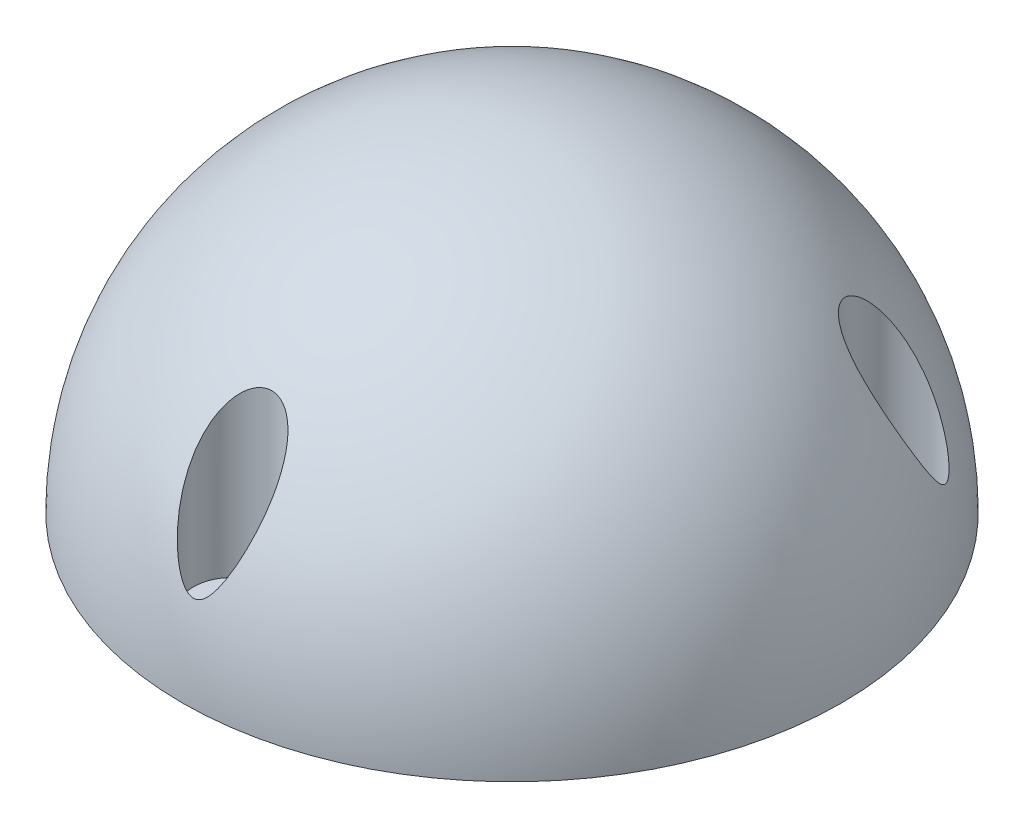
ISO-10303-21;
HEADER;
FILE_DESCRIPTION(('STEP AP214'),'2;1');
FILE_NAME('part.step','',(''),(''),'','','');
FILE_SCHEMA(('AUTOMOTIVE_DESIGN { 1 0 10303 214 1 1 1 1 }'));
ENDSEC;
DATA;
#1=APPLICATION_CONTEXT('core data for automotive mechanical design processes');
#2=APPLICATION_PROTOCOL_DEFINITION('international standard','automotive_design',2000,#1);
#3=PRODUCT_CONTEXT('',#1,'mechanical');
#4=PRODUCT('Part','Part','',(#3));
#5=PRODUCT_RELATED_PRODUCT_CATEGORY('part','',(#4));
#6=PRODUCT_DEFINITION_FORMATION('','',#4);
#7=PRODUCT_DEFINITION_CONTEXT('part definition',#1,'design');
#8=PRODUCT_DEFINITION('design','',#6,#7);
#9=PRODUCT_DEFINITION_SHAPE('','',#8);
#10=(LENGTH_UNIT() NAMED_UNIT(*) SI_UNIT(.MILLI.,.METRE.));
#11=(NAMED_UNIT(*) PLANE_ANGLE_UNIT() SI_UNIT($,.RADIAN.));
#12=(NAMED_UNIT(*) SI_UNIT($,.STERADIAN.) SOLID_ANGLE_UNIT());
#13=UNCERTAINTY_MEASURE_WITH_UNIT(LENGTH_MEASURE(1.E-05),#10,'distance_accuracy_value','');
#14=(GEOMETRIC_REPRESENTATION_CONTEXT(3) GLOBAL_UNCERTAINTY_ASSIGNED_CONTEXT((#13)) GLOBAL_UNIT_ASSIGNED_CONTEXT((#10,
#11,#12)) REPRESENTATION_CONTEXT('',''));
#15=CARTESIAN_POINT('',(0.,0.,0.));
#16=DIRECTION('',(0.,0.,1.));
#17=DIRECTION('',(1.,0.,0.));
#18=AXIS2_PLACEMENT_3D('',#15,#16,#17);
#19=CARTESIAN_POINT('',(0.,0.,0.));
#20=DIRECTION('',(0.,1.,0.));
#21=DIRECTION('',(0.,0.,1.));
#22=AXIS2_PLACEMENT_3D('',#19,#20,#21);
#23=PLANE('',#22);
#24=CARTESIAN_POINT('',(-21.6506350946083,0.,-12.5000000000015));
#25=DIRECTION('',(0.,-1.,0.));
#26=DIRECTION('',(0.,0.,-1.));
#27=AXIS2_PLACEMENT_3D('',#24,#25,#26);
#28=CIRCLE('',#27,2.00000000000322);
#29=CARTESIAN_POINT('',(-21.6506350946083,0.,-14.5000000000048));
#30=VERTEX_POINT('',#29);
#31=EDGE_CURVE('E94',#30,#30,#28,.T.);
#32=ORIENTED_EDGE('',*,*,#31,.F.);
#33=EDGE_LOOP('',(#32));
#34=FACE_BOUND('',#33,.T.);
#35=CARTESIAN_POINT('',(21.6506350946136,0.,-12.4999999999985));
#36=DIRECTION('',(0.,-1.,0.));
#37=DIRECTION('',(0.,0.,-1.));
#38=AXIS2_PLACEMENT_3D('',#35,#36,#37);
#39=CIRCLE('',#38,2.00000000000221);
#40=CARTESIAN_POINT('',(21.6506350946136,0.,-14.5000000000007));
#41=VERTEX_POINT('',#40);
#42=EDGE_CURVE('E98',#41,#41,#39,.T.);
#43=ORIENTED_EDGE('',*,*,#42,.F.);
#44=EDGE_LOOP('',(#43));
#45=FACE_BOUND('',#44,.T.);
#46=CARTESIAN_POINT('',(0.,0.,25.));
#47=DIRECTION('',(0.,-1.,0.));
#48=DIRECTION('',(0.,0.,-1.));
#49=AXIS2_PLACEMENT_3D('',#46,#47,#48);
#50=CIRCLE('',#49,2.);
#51=CARTESIAN_POINT('',(0.,0.,23.));
#52=VERTEX_POINT('',#51);
#53=EDGE_CURVE('E101',#52,#52,#50,.T.);
#54=ORIENTED_EDGE('',*,*,#53,.F.);
#55=EDGE_LOOP('',(#54));
#56=FACE_BOUND('',#55,.T.);
#57=CARTESIAN_POINT('',(0.,0.,0.));
#58=DIRECTION('',(0.,-1.,0.));
#59=DIRECTION('',(0.,0.,-1.));
#60=AXIS2_PLACEMENT_3D('',#57,#58,#59);
#61=CIRCLE('',#60,29.5);
#62=CARTESIAN_POINT('',(0.,0.,-29.5));
#63=VERTEX_POINT('',#62);
#64=EDGE_CURVE('E10',#63,#63,#61,.T.);
#65=ORIENTED_EDGE('',*,*,#64,.T.);
#66=EDGE_LOOP('',(#65));
#67=FACE_BOUND('',#66,.T.);
#68=ADVANCED_FACE('F36',(#34,#45,#56,#67),#23,.F.);
#69=CARTESIAN_POINT('',(0.,0.,0.));
#70=DIRECTION('',(0.,-1.,0.));
#71=DIRECTION('',(-1.,0.,0.));
#72=AXIS2_PLACEMENT_3D('',#69,#70,#71);
#73=SPHERICAL_SURFACE('',#72,29.5);
#74=CARTESIAN_POINT('',(-0.488308523328343,7.72732488135093,28.4657690035611));
#75=CARTESIAN_POINT('',(-0.608371770633554,7.78203568340793,28.4488565466985));
#76=CARTESIAN_POINT('',(-0.720373435943598,7.85300001036212,28.4267312727637));
#77=CARTESIAN_POINT('',(-0.876878730529687,7.97253460049884,28.3888073878368));
#78=CARTESIAN_POINT('',(-0.927390879795318,8.01484628510096,28.3752838740089));
#79=CARTESIAN_POINT('',(-1.02503106422688,8.10282838443857,28.3469217587781));
#80=CARTESIAN_POINT('',(-1.07216115278833,8.14849672651406,28.3320839677697));
#81=CARTESIAN_POINT('',(-1.17169921501466,8.25082388478656,28.2985396026142));
#82=CARTESIAN_POINT('',(-1.22351863065781,8.30797591788398,28.2796188574554));
#83=CARTESIAN_POINT('',(-1.32364974690187,8.42487327239608,28.2404987224315));
#84=CARTESIAN_POINT('',(-1.37196018118652,8.48461951770043,28.2202988758402));
#85=CARTESIAN_POINT('',(-1.51252541129436,8.66693724812773,28.1579786840746));
#86=CARTESIAN_POINT('',(-1.60025987033403,8.79242171043584,28.1141918312843));
#87=CARTESIAN_POINT('',(-1.76653387601041,9.04810152763951,28.0229654757487));
#88=CARTESIAN_POINT('',(-1.84506545850153,9.17830083706975,27.975522867312));
#89=CARTESIAN_POINT('',(-1.99454658143779,9.44163367993205,27.8774575186194));
#90=CARTESIAN_POINT('',(-2.0655023988026,9.57476467222599,27.8268374671442));
#91=CARTESIAN_POINT('',(-2.20648610351608,9.85386988738697,27.7184452988471));
#92=CARTESIAN_POINT('',(-2.27598028688019,10.0000158283025,27.6604254064517));
#93=CARTESIAN_POINT('',(-2.40844765491276,10.2939458400991,27.5411257917522));
#94=CARTESIAN_POINT('',(-2.47141960081964,10.4417302162873,27.4798454535284));
#95=CARTESIAN_POINT('',(-2.59145809634237,10.7385191722626,27.3541249050122));
#96=CARTESIAN_POINT('',(-2.64851939781477,10.8875247118041,27.289681960154));
#97=CARTESIAN_POINT('',(-2.75702541980816,11.1862588950391,27.157798812693));
#98=CARTESIAN_POINT('',(-2.80846956816513,11.3359876107765,27.0903583057406));
#99=CARTESIAN_POINT('',(-2.95486763569619,11.7863308348607,26.8834510120256));
#100=CARTESIAN_POINT('',(-3.04169493721801,12.0876211950669,26.7396020822086));
#101=CARTESIAN_POINT('',(-3.19394862356373,12.6900223586888,26.4410817167247));
#102=CARTESIAN_POINT('',(-3.25938458152812,12.9911331820632,26.2864151599298));
#103=CARTESIAN_POINT('',(-3.37430268460346,13.6268244795092,25.9484401761847));
#104=CARTESIAN_POINT('',(-3.42106041569286,13.9612435460745,25.7638889258295));
#105=CARTESIAN_POINT('',(-3.48429481077766,14.6268648176825,25.3833116772001));
#106=CARTESIAN_POINT('',(-3.50075096302886,14.9580646928415,25.1872779987944));
#107=CARTESIAN_POINT('',(-3.49958809406831,15.4495029359383,24.8867912682131));
#108=CARTESIAN_POINT('',(-3.49494073236267,15.6119809348832,24.7858437443807));
#109=CARTESIAN_POINT('',(-3.47645194229722,15.9351358906804,24.5819504556774));
#110=CARTESIAN_POINT('',(-3.46261226525432,16.0958131846741,24.4790050750638));
#111=CARTESIAN_POINT('',(-3.42499028554176,16.4147578503908,24.2716226348939));
#112=CARTESIAN_POINT('',(-3.40122005916968,16.5730279080286,24.1671875354345));
#113=CARTESIAN_POINT('',(-3.34282701455488,16.8867803089808,23.9572248055224));
#114=CARTESIAN_POINT('',(-3.30820774487222,17.0422635462678,23.8516975431975));
#115=CARTESIAN_POINT('',(-3.23846284082462,17.3064624484105,23.6699713469129));
#116=CARTESIAN_POINT('',(-3.20622484672358,17.4160186936944,23.5938813991998));
#117=CARTESIAN_POINT('',(-3.13512128086333,17.6330083652869,23.4417756230243));
#118=CARTESIAN_POINT('',(-3.09625647406093,17.7404420350166,23.3657597870244));
#119=CARTESIAN_POINT('',(-3.0113035257548,17.9529630179969,23.2140485704887));
#120=CARTESIAN_POINT('',(-2.96520340416735,18.0580461034823,23.1383539391801));
#121=CARTESIAN_POINT('',(-2.86524279828906,18.2651483887588,22.9879014796325));
#122=CARTESIAN_POINT('',(-2.81138322695256,18.3671679472916,22.913143542308));
#123=CARTESIAN_POINT('',(-2.69457727611994,18.5686487819968,22.7643108957661));
#124=CARTESIAN_POINT('',(-2.63153336545121,18.6680670484084,22.6902539781452));
#125=CARTESIAN_POINT('',(-2.49608472127315,18.8622435699754,22.5445038707841));
#126=CARTESIAN_POINT('',(-2.42367771259387,18.9570006847517,22.4728112608862));
#127=CARTESIAN_POINT('',(-2.26900211213893,19.1403848333052,22.3330809070919));
#128=CARTESIAN_POINT('',(-2.18676559841718,19.2290303950268,22.2650322700415));
#129=CARTESIAN_POINT('',(-2.01159009733782,19.3989812698169,22.1337348781893));
#130=CARTESIAN_POINT('',(-1.91865635196015,19.4802901435395,22.0704837974309));
#131=CARTESIAN_POINT('',(-1.70967958256366,19.6429333674558,21.9432508514363));
#132=CARTESIAN_POINT('',(-1.5922015205156,19.7230956896369,21.880095249507));
#133=CARTESIAN_POINT('',(-1.34302034586855,19.8684158549551,21.7650268870875));
#134=CARTESIAN_POINT('',(-1.2113225808867,19.9335793100564,21.7131099219918));
#135=CARTESIAN_POINT('',(-1.00362367495445,20.0172930816306,21.6461754742678));
#136=CARTESIAN_POINT('',(-0.932218561112406,20.0429749394303,21.6255936822294));
#137=CARTESIAN_POINT('',(-0.786630060515146,20.0889174124583,21.5887184803882));
#138=CARTESIAN_POINT('',(-0.712448303822985,20.1091811532747,21.5724225982309));
#139=CARTESIAN_POINT('',(-0.561911448924453,20.1437977641765,21.5445542844233));
#140=CARTESIAN_POINT('',(-0.485558418818336,20.1581560699571,21.5329775091288));
#141=CARTESIAN_POINT('',(-0.331378843204277,20.1806169675628,21.5148563892362));
#142=CARTESIAN_POINT('',(-0.253552586719478,20.1887207736517,21.5083110678205));
#143=CARTESIAN_POINT('',(-0.0418012626704663,20.2018489341156,21.4977081712566));
#144=CARTESIAN_POINT('',(0.0928554542573941,20.2006376701093,21.4986873783667));
#145=CARTESIAN_POINT('',(0.359558402513643,20.1792642893736,21.5159477990496));
#146=CARTESIAN_POINT('',(0.491604563954923,20.1591016659975,21.5322294217181));
#147=CARTESIAN_POINT('',(0.740854517540515,20.1033550042039,21.5771164695152));
#148=CARTESIAN_POINT('',(0.858465317056156,20.0688573884273,21.6048529831723));
#149=CARTESIAN_POINT('',(1.08590965067783,19.9867759294222,21.6706094118803));
#150=CARTESIAN_POINT('',(1.19574082575443,19.9391881380173,21.7086324294246));
#151=CARTESIAN_POINT('',(1.45776831767476,19.8072697290188,21.8135648075496));
#152=CARTESIAN_POINT('',(1.60460654832637,19.7163230099668,21.8855313112751));
#153=CARTESIAN_POINT('',(1.87797672314093,19.5165715101744,22.0422685650147));
#154=CARTESIAN_POINT('',(2.00445736832479,19.4077229707817,22.127070648402));
#155=CARTESIAN_POINT('',(2.20924559635187,19.2055158454368,22.2831150446532));
#156=CARTESIAN_POINT('',(2.29175010836794,19.1149325670684,22.3525620971864));
#157=CARTESIAN_POINT('',(2.44653522679785,18.9278570416375,22.4948994906725));
#158=CARTESIAN_POINT('',(2.51881057810357,18.8313617935832,22.5677915760045));
#159=CARTESIAN_POINT('',(2.6539346578609,18.6335783750073,22.7159910058179));
#160=CARTESIAN_POINT('',(2.71677317291584,18.532285165399,22.791300861584));
#161=CARTESIAN_POINT('',(2.833704594889,18.3258633567789,22.9434680137094));
#162=CARTESIAN_POINT('',(2.88779450210407,18.2207334573309,23.0203258307154));
#163=CARTESIAN_POINT('',(3.01989133824054,17.9391972751969,23.2243142499314));
#164=CARTESIAN_POINT('',(3.09111490669231,17.7601446375813,23.3522074002614));
#165=CARTESIAN_POINT('',(3.21458375696057,17.3958432964497,23.6083577248232));
#166=CARTESIAN_POINT('',(3.26681714829738,17.21059078995,23.7366150766247));
#167=CARTESIAN_POINT('',(3.35452854154228,16.8350769602383,23.9923099989364));
#168=CARTESIAN_POINT('',(3.38997199375526,16.6448061520743,24.1197453513495));
#169=CARTESIAN_POINT('',(3.44571689203803,16.2607643757448,24.3724889309762));
#170=CARTESIAN_POINT('',(3.46602004724842,16.0669938051867,24.4977973967263));
#171=CARTESIAN_POINT('',(3.50081108436178,15.5631202161589,24.8176895754159));
#172=CARTESIAN_POINT('',(3.50503966443095,15.2509377291046,25.0101526167516));
#173=CARTESIAN_POINT('',(3.48374615348067,14.6220070495949,25.3859190884874));
#174=CARTESIAN_POINT('',(3.45820464336367,14.3052560102337,25.5692164587225));
#175=CARTESIAN_POINT('',(3.38045133258904,13.6692851531443,25.9250340085913));
#176=CARTESIAN_POINT('',(3.32825514636855,13.3500668884318,26.0975604315673));
#177=CARTESIAN_POINT('',(3.19916870059628,12.7106575403825,26.4308259915656));
#178=CARTESIAN_POINT('',(3.12229001660019,12.3904669826164,26.5915706106791));
#179=CARTESIAN_POINT('',(2.98244340891559,11.8873044201568,26.8345131052726));
#180=CARTESIAN_POINT('',(2.92754255835896,11.70409314829,26.9209536607423));
#181=CARTESIAN_POINT('',(2.80970197667033,11.3382821853252,27.0895357292187));
#182=CARTESIAN_POINT('',(2.7467629727215,11.1556824404362,27.171677630163));
#183=CARTESIAN_POINT('',(2.61244389015877,10.7915037876941,27.3315325366868));
#184=CARTESIAN_POINT('',(2.54105878963511,10.6099255551045,27.4092428662231));
#185=CARTESIAN_POINT('',(2.38916402378966,10.2486568323317,27.5599525417763));
#186=CARTESIAN_POINT('',(2.30865631200583,10.0689659469594,27.6329528911647));
#187=CARTESIAN_POINT('',(2.16327589058753,9.7668311154624,27.7524878892352));
#188=CARTESIAN_POINT('',(2.10109770760853,9.64360191513863,27.8003177468928));
#189=CARTESIAN_POINT('',(1.97097210519612,9.399238109873,27.893384691176));
#190=CARTESIAN_POINT('',(1.90302583705759,9.27810309272029,27.9386222922041));
#191=CARTESIAN_POINT('',(1.76053295064439,9.03921680093387,28.026135628345));
#192=CARTESIAN_POINT('',(1.68600761691196,8.92145613696706,28.0684201755742));
#193=CARTESIAN_POINT('',(1.52866459489798,8.69050102377671,28.149769474946));
#194=CARTESIAN_POINT('',(1.44585430134903,8.57730262691286,28.1888370426038));
#195=CARTESIAN_POINT('',(1.29808382973772,8.39371282252499,28.2510217270074));
#196=CARTESIAN_POINT('',(1.23604438268968,8.3213445160897,28.2752027348385));
#197=CARTESIAN_POINT('',(1.10584102087525,8.1812811986481,28.3214307102411));
#198=CARTESIAN_POINT('',(1.03766742738462,8.11359388196344,28.3434741871139));
#199=CARTESIAN_POINT('',(0.893237552916325,7.98479780136259,28.3849436672968));
#200=CARTESIAN_POINT('',(0.816908055787089,7.92376065716907,28.404341651896));
#201=CARTESIAN_POINT('',(0.655333911558732,7.81336810110003,28.4390861334518));
#202=CARTESIAN_POINT('',(0.570118217354489,7.76397636181545,28.454445247279));
#203=CARTESIAN_POINT('',(0.423960336337827,7.69844264250328,28.4746927640664));
#204=CARTESIAN_POINT('',(0.365779927106526,7.67676669212621,28.4813508394745));
#205=CARTESIAN_POINT('',(0.246536039567414,7.64260730937155,28.491816963114));
#206=CARTESIAN_POINT('',(0.185476995431965,7.63011020069247,28.4956292516534));
#207=CARTESIAN_POINT('',(0.0615517648079429,7.61574219897191,28.500010595378));
#208=CARTESIAN_POINT('',(-0.00132373698563006,7.61394250114096,28.500557921119));
#209=CARTESIAN_POINT('',(-0.126367825092132,7.62142670756571,28.4982773296019));
#210=CARTESIAN_POINT('',(-0.188536067175256,7.63071579387088,28.495447834276));
#211=CARTESIAN_POINT('',(-0.29062673066652,7.65454703297118,28.4881598652024));
#212=CARTESIAN_POINT('',(-0.331265723286447,7.66643410711371,28.4845194376969));
#213=CARTESIAN_POINT('',(-0.410977336435927,7.69410951952161,28.4760175570382));
#214=CARTESIAN_POINT('',(-0.450052169121532,7.70989210429876,28.471157904451));
#215=CARTESIAN_POINT('',(-0.488308523328343,7.72732488135093,28.4657690035611));
#216=B_SPLINE_CURVE_WITH_KNOTS('',3,(#74,#75,#76,#77,#78,#79,#80,#81,#82,#83,#84,#85,#86,#87,
#88,#89,#90,#91,#92,#93,#94,#95,#96,#97,#98,#99,#100,#101,#102,#103,#104,#105,#106,#107,#108,
#109,#110,#111,#112,#113,#114,#115,#116,#117,#118,#119,#120,#121,#122,#123,#124,#125,#126,#127,
#128,#129,#130,#131,#132,#133,#134,#135,#136,#137,#138,#139,#140,#141,#142,#143,#144,#145,#146,
#147,#148,#149,#150,#151,#152,#153,#154,#155,#156,#157,#158,#159,#160,#161,#162,#163,#164,#165,
#166,#167,#168,#169,#170,#171,#172,#173,#174,#175,#176,#177,#178,#179,#180,#181,#182,#183,#184,
#185,#186,#187,#188,#189,#190,#191,#192,#193,#194,#195,#196,#197,#198,#199,#200,#201,#202,#203,
#204,#205,#206,#207,#208,#209,#210,#211,#212,#213,#214,#215),.UNSPECIFIED.,.T.,.F.,(4,2,2,2,2,2,
2,2,2,2,2,2,2,2,2,2,2,2,2,2,2,2,2,2,2,2,2,2,2,2,2,2,2,2,2,2,2,2,2,2,2,2,2,2,2,2,2,2,2,2,2,2,2,2,
2,2,2,2,2,2,2,2,2,2,2,2,2,2,2,2,4),(0.,0.398823547767263,0.600599886250246,0.802252662503609,
1.04040162006629,1.27863609782842,1.75580086322522,2.23337556310233,2.71055144524079,
3.22610884385276,3.74176398285931,4.2578731237418,4.7740347866299,5.80802454317278,
6.84155092894557,7.99474272102832,9.14871484511093,9.72254177102202,10.2962594029621,
10.8692813725121,11.4421161104125,11.8536466073914,12.2651296320469,12.6773013128738,
13.0894245383214,13.5062953638579,13.9232676772272,14.3389145837447,14.7543586704267,
15.219746295501,15.6849595074227,15.9205377762191,16.1559798506375,16.3912047232637,
16.6263839172691,17.0279604020377,17.4295476228816,17.8050574155676,18.1806805915755,
18.7388908151292,19.2984863626744,19.7204396678138,20.1426089655786,20.5652319302897,
20.9879994972291,21.6807311525109,22.3738958097219,23.0684807043513,23.7629871775984,
24.8616409177892,25.9610117135759,27.0597392301967,28.1579522183041,28.7874457823734,
29.4168824386829,30.0466952463891,30.6763734384371,31.1144902944279,31.5525199081124,
31.9891809966143,32.4254557629651,32.7202426770821,33.0155031604498,33.3136814277612,
33.6109168544479,33.7975880434516,33.9839805285077,34.1716121474879,34.3593314854712,
34.4865974841257,34.6136766299247),.UNSPECIFIED.);
#217=CARTESIAN_POINT('',(-0.488308523328343,7.72732488135093,28.4657690035611));
#218=VERTEX_POINT('',#217);
#219=EDGE_CURVE('E43',#218,#218,#216,.T.);
#220=ORIENTED_EDGE('',*,*,#219,.T.);
#221=EDGE_LOOP('',(#220));
#222=FACE_BOUND('',#221,.T.);
#223=CARTESIAN_POINT('',(-24.5898748608566,7.63029907970284,-14.4002288274074));
#224=CARTESIAN_POINT('',(-24.5448578721049,7.64397947534741,-14.4698503069446));
#225=CARTESIAN_POINT('',(-24.4981388728317,7.6671394272064,-14.5366157445964));
#226=CARTESIAN_POINT('',(-24.4037895362534,7.72807582501067,-14.6625066038658));
#227=CARTESIAN_POINT('',(-24.3561555657564,7.76593320520778,-14.7215872596807));
#228=CARTESIAN_POINT('',(-24.238947125202,7.8718498746416,-14.8584281647657));
#229=CARTESIAN_POINT('',(-24.169651041782,7.94572508114379,-14.9318071860084));
#230=CARTESIAN_POINT('',(-24.0330494181974,8.10556176304747,-15.0657903735205));
#231=CARTESIAN_POINT('',(-23.9657483658123,8.19154830436753,-15.1263673772792));
#232=CARTESIAN_POINT('',(-23.852121417095,8.34484260424436,-15.2216211825584));
#233=CARTESIAN_POINT('',(-23.8053582673708,8.41036076619481,-15.2587219022357));
#234=CARTESIAN_POINT('',(-23.7125599474176,8.54410199920156,-15.3287533267938));
#235=CARTESIAN_POINT('',(-23.6665250074772,8.61232590290874,-15.3616827347353));
#236=CARTESIAN_POINT('',(-23.5291572376739,8.82017965838397,-15.4552479495573));
#237=CARTESIAN_POINT('',(-23.4387052430116,8.96279156506646,-15.5105435037264));
#238=CARTESIAN_POINT('',(-23.2588778252555,9.25333153767293,-15.6103272377533));
#239=CARTESIAN_POINT('',(-23.1695099680516,9.40128246490817,-15.6547604478946));
#240=CARTESIAN_POINT('',(-22.9917805736683,9.70005794191283,-15.7343148844345));
#241=CARTESIAN_POINT('',(-22.9034182531044,9.85087996931048,-15.7694439137793));
#242=CARTESIAN_POINT('',(-22.721967239309,10.163612831325,-15.8334735425785));
#243=CARTESIAN_POINT('',(-22.6289136300034,10.3256453644258,-15.8618729742635));
#244=CARTESIAN_POINT('',(-22.4431817926223,10.6511645385776,-15.9104366764343));
#245=CARTESIAN_POINT('',(-22.3505036100686,10.8146513487119,-15.930599976203));
#246=CARTESIAN_POINT('',(-22.1653224736307,11.1426939425205,-15.9632272615914));
#247=CARTESIAN_POINT('',(-22.0728197716571,11.3072505980517,-15.9756838750441));
#248=CARTESIAN_POINT('',(-21.8880538159176,11.6368985431197,-15.9931699300635));
#249=CARTESIAN_POINT('',(-21.795790587174,11.8019898847709,-15.9981986243979));
#250=CARTESIAN_POINT('',(-21.5197290045591,12.2970432408266,-16.0023926769218));
#251=CARTESIAN_POINT('',(-21.3363246224657,12.6273785632796,-15.9907233502047));
#252=CARTESIAN_POINT('',(-20.9717703881652,13.2869466179924,-15.938461527737));
#253=CARTESIAN_POINT('',(-20.7906202438393,13.6161794889872,-15.89787282011));
#254=CARTESIAN_POINT('',(-20.470415342333,14.2026010386276,-15.7983216821579));
#255=CARTESIAN_POINT('',(-20.330551317888,14.460317933155,-15.745051287444));
#256=CARTESIAN_POINT('',(-20.0548644554073,14.9731836965425,-15.6187363448459));
#257=CARTESIAN_POINT('',(-19.9190424688311,15.2283320169435,-15.545687662914));
#258=CARTESIAN_POINT('',(-19.6537059555286,15.734243810948,-15.3786794391372));
#259=CARTESIAN_POINT('',(-19.5241771978279,15.9850162688226,-15.2847700359946));
#260=CARTESIAN_POINT('',(-19.2736769530913,16.4812058120216,-15.0742638301082));
#261=CARTESIAN_POINT('',(-19.1527000620192,16.7266262103309,-14.9576815325993));
#262=CARTESIAN_POINT('',(-18.9745705398226,17.101157611497,-14.757804424876));
#263=CARTESIAN_POINT('',(-18.9131977727465,17.2329033405237,-14.6831428675729));
#264=CARTESIAN_POINT('',(-18.7948793693064,17.4936239023035,-14.5259177799743));
#265=CARTESIAN_POINT('',(-18.7379326563438,17.6225994033316,-14.4433561822639));
#266=CARTESIAN_POINT('',(-18.6293866366232,17.8771571314286,-14.2698939791173));
#267=CARTESIAN_POINT('',(-18.5777869290826,18.0027396122976,-14.1789939996454));
#268=CARTESIAN_POINT('',(-18.4810847742026,18.2496708455615,-13.9884120591897));
#269=CARTESIAN_POINT('',(-18.4359807085818,18.3710206467296,-13.8887322955516));
#270=CARTESIAN_POINT('',(-18.3638788935436,18.579011147918,-13.7059614597615));
#271=CARTESIAN_POINT('',(-18.3351628635533,18.6668081551064,-13.6248716786011));
#272=CARTESIAN_POINT('',(-18.282961498602,18.8387560470592,-13.4573295261338));
#273=CARTESIAN_POINT('',(-18.2594773520238,18.9229060999564,-13.3708759421695));
#274=CARTESIAN_POINT('',(-18.1982206728622,19.1685278281249,-13.1035207573333));
#275=CARTESIAN_POINT('',(-18.1694718565102,19.3236495075583,-12.9142125128064));
#276=CARTESIAN_POINT('',(-18.1489319172692,19.5614044153866,-12.5795585654647));
#277=CARTESIAN_POINT('',(-18.148178287749,19.6512304211043,-12.4398682657273));
#278=CARTESIAN_POINT('',(-18.1649787750323,19.8149167525462,-12.1523632655511));
#279=CARTESIAN_POINT('',(-18.1825079559477,19.8887986587294,-12.0045598906698));
#280=CARTESIAN_POINT('',(-18.2337788265362,20.0042930333915,-11.7314082902842));
#281=CARTESIAN_POINT('',(-18.2639944728623,20.0493300169762,-11.606861762034));
#282=CARTESIAN_POINT('',(-18.3398005452757,20.1228035723731,-11.3574991749244));
#283=CARTESIAN_POINT('',(-18.3853800860589,20.151251858413,-11.2326833688844));
#284=CARTESIAN_POINT('',(-18.4921490178059,20.1895040548269,-10.9860308165579));
#285=CARTESIAN_POINT('',(-18.553420788751,20.199207188141,-10.8642136298404));
#286=CARTESIAN_POINT('',(-18.6898067445563,20.1988065309535,-10.6286337956516));
#287=CARTESIAN_POINT('',(-18.7649193925479,20.1887049383373,-10.5148702558558));
#288=CARTESIAN_POINT('',(-18.9191367639417,20.1512656379294,-10.3081654673192));
#289=CARTESIAN_POINT('',(-18.9973611520363,20.1254640834765,-10.2142764152151));
#290=CARTESIAN_POINT('',(-19.1602588153822,20.0597296799464,-10.0377911492262));
#291=CARTESIAN_POINT('',(-19.2449344221045,20.0197917027705,-9.95519904849336));
#292=CARTESIAN_POINT('',(-19.4511573025166,19.9104183459894,-9.77277619386598));
#293=CARTESIAN_POINT('',(-19.5745219882755,19.8355400149685,-9.67826573470609));
#294=CARTESIAN_POINT('',(-19.8238719213129,19.6682357048603,-9.51074835935057));
#295=CARTESIAN_POINT('',(-19.9498620729574,19.5757736542686,-9.43778644774495));
#296=CARTESIAN_POINT('',(-20.2595178837102,19.3317041089157,-9.28172781530118));
#297=CARTESIAN_POINT('',(-20.4428023838378,19.1725676791822,-9.20965387431413));
#298=CARTESIAN_POINT('',(-20.7121029672569,18.9202291852701,-9.1268712888956));
#299=CARTESIAN_POINT('',(-20.8010520225228,18.8337140642753,-9.10348365206251));
#300=CARTESIAN_POINT('',(-20.9768013542629,18.6568535526985,-9.06429846360543));
#301=CARTESIAN_POINT('',(-21.0636020417168,18.5665089038112,-9.04849944947662));
#302=CARTESIAN_POINT('',(-21.2877616410351,18.3257718939888,-9.01604365668718));
#303=CARTESIAN_POINT('',(-21.4231675999894,18.1728173108854,-9.00490615331784));
#304=CARTESIAN_POINT('',(-21.6870681179115,17.8606908444624,-8.99770105889447));
#305=CARTESIAN_POINT('',(-21.8155584209909,17.7015152344102,-9.00164264235657));
#306=CARTESIAN_POINT('',(-22.0654216199942,17.3782989378733,-9.02240319379895));
#307=CARTESIAN_POINT('',(-22.186787881952,17.2142539244243,-9.03923396572696));
#308=CARTESIAN_POINT('',(-22.4222106669916,16.882453672892,-9.08400469387857));
#309=CARTESIAN_POINT('',(-22.536264766949,16.7146972294233,-9.11194831083653));
#310=CARTESIAN_POINT('',(-22.8258550493537,16.2708091732181,-9.19790352721819));
#311=CARTESIAN_POINT('',(-22.9954169307521,15.9922833724901,-9.26380116605127));
#312=CARTESIAN_POINT('',(-23.3155030239556,15.4299243061616,-9.41622982442666));
#313=CARTESIAN_POINT('',(-23.4660148445934,15.1460877225018,-9.50277416918446));
#314=CARTESIAN_POINT('',(-23.7486913102618,14.5739474064704,-9.69334616129385));
#315=CARTESIAN_POINT('',(-23.8807937978242,14.2856320271484,-9.79743053721661));
#316=CARTESIAN_POINT('',(-24.1262470319081,13.7068820599696,-10.0203187273225));
#317=CARTESIAN_POINT('',(-24.2396034726035,13.4164481437165,-10.1391180525433));
#318=CARTESIAN_POINT('',(-24.4534221232319,12.8184598451576,-10.3966848754088));
#319=CARTESIAN_POINT('',(-24.5528248842044,12.5108467230302,-10.5361932451493));
#320=CARTESIAN_POINT('',(-24.7306268483657,11.8957056860916,-10.8287683708157));
#321=CARTESIAN_POINT('',(-24.8090134372088,11.5881779326388,-10.9818431966051));
#322=CARTESIAN_POINT('',(-24.9098144212949,11.1294690832173,-11.2212632223803));
#323=CARTESIAN_POINT('',(-24.9405592771423,10.9773929627289,-11.3024783028774));
#324=CARTESIAN_POINT('',(-24.9963303801014,10.674160505097,-11.4684962876134));
#325=CARTESIAN_POINT('',(-25.0213573146483,10.5230040595151,-11.5532987591051));
#326=CARTESIAN_POINT('',(-25.0653203266718,10.2222179114721,-11.7267460915982));
#327=CARTESIAN_POINT('',(-25.0842625288236,10.0725868215107,-11.8153869863162));
#328=CARTESIAN_POINT('',(-25.1155515166741,9.77539138178482,-11.9971397820159));
#329=CARTESIAN_POINT('',(-25.127900339565,9.62782640737955,-12.0902502922941));
#330=CARTESIAN_POINT('',(-25.1404179689597,9.41596636971017,-12.2292756281267));
#331=CARTESIAN_POINT('',(-25.1435517232962,9.35042856232449,-12.2730399350105));
#332=CARTESIAN_POINT('',(-25.1481872732679,9.22013736690554,-12.3617945434002));
#333=CARTESIAN_POINT('',(-25.1496891191661,9.15538395477349,-12.4067848071027));
#334=CARTESIAN_POINT('',(-25.1515613921747,8.96221355149378,-12.54402922636));
#335=CARTESIAN_POINT('',(-25.149279481158,8.83519096529298,-12.6383593520456));
#336=CARTESIAN_POINT('',(-25.1389483384404,8.64188929045938,-12.7909673670515));
#337=CARTESIAN_POINT('',(-25.133885227455,8.57351883895324,-12.8468052736165));
#338=CARTESIAN_POINT('',(-25.1206048970265,8.43934563510576,-12.9611133703971));
#339=CARTESIAN_POINT('',(-25.1123888398629,8.37354194640713,-13.0195825836241));
#340=CARTESIAN_POINT('',(-25.0922558707747,8.24564052037033,-13.139477485265));
#341=CARTESIAN_POINT('',(-25.0803508438818,8.18353163443923,-13.2008931513511));
#342=CARTESIAN_POINT('',(-25.0520516019949,8.06432108531811,-13.3273843482756));
#343=CARTESIAN_POINT('',(-25.0356630209535,8.00721325599416,-13.3924552050588));
#344=CARTESIAN_POINT('',(-25.0004049190561,7.90885246207222,-13.5161113869227));
#345=CARTESIAN_POINT('',(-24.9823547700941,7.86652558684983,-13.5740632448574));
#346=CARTESIAN_POINT('',(-24.9415667985572,7.78909120138701,-13.6932013460365));
#347=CARTESIAN_POINT('',(-24.9188278459044,7.75398543563319,-13.754388366359));
#348=CARTESIAN_POINT('',(-24.8675795717539,7.69343553497322,-13.8805681750194));
#349=CARTESIAN_POINT('',(-24.8389869981601,7.66814805137335,-13.9456049780567));
#350=CARTESIAN_POINT('',(-24.7761464154851,7.63157429285108,-14.0768330449617));
#351=CARTESIAN_POINT('',(-24.7419185775851,7.62023925996998,-14.1430194641203));
#352=CARTESIAN_POINT('',(-24.6871599504564,7.61515704366188,-14.2409596561743));
#353=CARTESIAN_POINT('',(-24.6683093936023,7.61545832435549,-14.2734267418664));
#354=CARTESIAN_POINT('',(-24.6297102797572,7.61997778262569,-14.3375282045378));
#355=CARTESIAN_POINT('',(-24.6099620103234,7.62419471422447,-14.3691628431127));
#356=CARTESIAN_POINT('',(-24.5898748608566,7.63029907970284,-14.4002288274074));
#357=B_SPLINE_CURVE_WITH_KNOTS('',3,(#223,#224,#225,#226,#227,#228,#229,#230,#231,#232,#233,
#234,#235,#236,#237,#238,#239,#240,#241,#242,#243,#244,#245,#246,#247,#248,#249,#250,#251,#252,
#253,#254,#255,#256,#257,#258,#259,#260,#261,#262,#263,#264,#265,#266,#267,#268,#269,#270,#271,
#272,#273,#274,#275,#276,#277,#278,#279,#280,#281,#282,#283,#284,#285,#286,#287,#288,#289,#290,
#291,#292,#293,#294,#295,#296,#297,#298,#299,#300,#301,#302,#303,#304,#305,#306,#307,#308,#309,
#310,#311,#312,#313,#314,#315,#316,#317,#318,#319,#320,#321,#322,#323,#324,#325,#326,#327,#328,
#329,#330,#331,#332,#333,#334,#335,#336,#337,#338,#339,#340,#341,#342,#343,#344,#345,#346,#347,
#348,#349,#350,#351,#352,#353,#354,#355,#356),.UNSPECIFIED.,.T.,.F.,(4,2,2,2,2,2,2,2,2,2,2,2,2,
2,2,2,2,2,2,2,2,2,2,2,2,2,2,2,2,2,2,2,2,2,2,2,2,2,2,2,2,2,2,2,2,2,2,2,2,2,2,2,2,2,2,2,2,2,2,2,2,
2,2,2,2,2,4),(0.,0.251877385406735,0.505161919020773,0.878240641014265,1.25210316235897,
1.51784614517765,1.78367155074605,2.31613709737904,2.85124389729388,3.38590049890132,
3.95268754383577,4.51954137148639,5.08693661286493,5.65438892906842,6.7872472988347,
7.91995730377614,8.81340616616752,9.70704192115327,10.598552627312,11.4894948448121,
11.9794545305062,12.4692946624074,12.9590980519391,13.4487792031903,13.8172495650274,
14.1858035369736,14.9209638211583,15.4176853771432,15.9137303404229,16.3196108435523,
16.7252043830744,17.1329724583006,17.5406952828734,17.9138025519455,18.2870453075591,
18.8016658508083,19.3173537101878,20.0724722643908,20.4510871646942,20.8296290677581,
21.4424209035377,22.0555856373913,22.6693125813967,23.2832418637562,24.2797247206492,
25.2768524476067,26.2772692893329,27.277381690734,28.3327902322685,29.3888308410382,
29.9140970339523,30.4393000436372,30.9639727339744,31.48848321939,31.7250627166531,
31.9616349270154,32.4358687290258,32.7010297987994,32.9660932152493,33.230311383245,
33.4941990525012,33.7157666043544,33.9373876201313,34.1624120365646,34.3866478339054,
34.4990744698094,34.6114653433051),.UNSPECIFIED.);
#358=CARTESIAN_POINT('',(-24.5898748608566,7.63029907970284,-14.4002288274074));
#359=VERTEX_POINT('',#358);
#360=EDGE_CURVE('E48',#359,#359,#357,.T.);
#361=ORIENTED_EDGE('',*,*,#360,.T.);
#362=EDGE_LOOP('',(#361));
#363=FACE_BOUND('',#362,.T.);
#364=CARTESIAN_POINT('',(24.5898748608603,7.630299079692,-14.4002288274069));
#365=CARTESIAN_POINT('',(24.6228860147886,7.6202870129332,-14.3491638431378));
#366=CARTESIAN_POINT('',(24.6550319829845,7.61534071733315,-14.2964954157794));
#367=CARTESIAN_POINT('',(24.7164279753134,7.61626593920632,-14.1895906658003));
#368=CARTESIAN_POINT('',(24.745677623685,7.62213885840451,-14.1353541409148));
#369=CARTESIAN_POINT('',(24.8003477448817,7.64385211086406,-14.0274030041145));
#370=CARTESIAN_POINT('',(24.8257883993728,7.65963742852365,-13.9736871624613));
#371=CARTESIAN_POINT('',(24.8728696683911,7.69943360873273,-13.867690733629));
#372=CARTESIAN_POINT('',(24.8945067207631,7.723452120412,-13.8154115301355));
#373=CARTESIAN_POINT('',(24.9480403242509,7.79678984245167,-13.6772129351356));
#374=CARTESIAN_POINT('',(24.9765952669101,7.85208302518165,-13.5932065997472));
#375=CARTESIAN_POINT('',(25.0255383746199,7.97401297112811,-13.4312511622769));
#376=CARTESIAN_POINT('',(25.0458953892776,8.04069165613655,-13.3533260546533));
#377=CARTESIAN_POINT('',(25.0856866298148,8.20342209035532,-13.1788118006469));
#378=CARTESIAN_POINT('',(25.1027750001881,8.30207745146514,-13.0841538416811));
#379=CARTESIAN_POINT('',(25.1287295336883,8.50663539065251,-12.9016716225455));
#380=CARTESIAN_POINT('',(25.1375792938188,8.61255197779062,-12.8138613129238));
#381=CARTESIAN_POINT('',(25.1487513052803,8.82939552201492,-12.6432285172119));
#382=CARTESIAN_POINT('',(25.1510434949679,8.94034319262907,-12.5604306997841));
#383=CARTESIAN_POINT('',(25.1501103851842,9.16517884141328,-12.3992165379088));
#384=CARTESIAN_POINT('',(25.1468894896565,9.27906440118256,-12.3207967478861));
#385=CARTESIAN_POINT('',(25.1352251652733,9.51769215403242,-12.1616663487242));
#386=CARTESIAN_POINT('',(25.1264030559494,9.64260114048786,-12.0812353470313));
#387=CARTESIAN_POINT('',(25.1037976058524,9.89414484972569,-11.9238161549131));
#388=CARTESIAN_POINT('',(25.0900133240628,10.0207798954491,-11.8468286206155));
#389=CARTESIAN_POINT('',(25.0578702311613,10.275369266405,-11.6958157538809));
#390=CARTESIAN_POINT('',(25.0395076076895,10.4033246054877,-11.6217929500802));
#391=CARTESIAN_POINT('',(24.9984887019462,10.6601074608525,-11.4764917245104));
#392=CARTESIAN_POINT('',(24.9758320105912,10.7889350591038,-11.4052135649947));
#393=CARTESIAN_POINT('',(24.9017516180131,11.1761853061331,-11.1952785748918));
#394=CARTESIAN_POINT('',(24.8441976361267,11.4355299715753,-11.0604304894457));
#395=CARTESIAN_POINT('',(24.7137175585627,11.9550063256248,-10.8003987101731));
#396=CARTESIAN_POINT('',(24.6407973744475,12.2151376737616,-10.6752113249903));
#397=CARTESIAN_POINT('',(24.463316802936,12.7891858549593,-10.4097017822436));
#398=CARTESIAN_POINT('',(24.3553313814923,13.1030873477478,-10.2716126285128));
#399=CARTESIAN_POINT('',(24.1176750294839,13.7293687177943,-10.0110635048611));
#400=CARTESIAN_POINT('',(23.9879946355215,14.0417478695409,-9.88861039670025));
#401=CARTESIAN_POINT('',(23.7071655042175,14.6625678711929,-9.66219413380643));
#402=CARTESIAN_POINT('',(23.5560701912229,14.971016500163,-9.55818637446013));
#403=CARTESIAN_POINT('',(23.2318969000877,15.5827907577272,-9.37197468907326));
#404=CARTESIAN_POINT('',(23.0588363241087,15.8861202287946,-9.28975365982938));
#405=CARTESIAN_POINT('',(22.782065987679,16.3361263193094,-9.1864521991661));
#406=CARTESIAN_POINT('',(22.6866806918322,16.4856717837192,-9.15530311648933));
#407=CARTESIAN_POINT('',(22.4902441128588,16.7824055283126,-9.10066843158133));
#408=CARTESIAN_POINT('',(22.3891941720879,16.9295943564106,-9.0771810226774));
#409=CARTESIAN_POINT('',(22.181378321882,17.2211461013219,-9.03886141926129));
#410=CARTESIAN_POINT('',(22.0746100650662,17.3655078238756,-9.02403280939882));
#411=CARTESIAN_POINT('',(21.8554632062777,17.6506181250988,-9.00426677511384));
#412=CARTESIAN_POINT('',(21.7430854595174,17.7913672496139,-8.99932784762087));
#413=CARTESIAN_POINT('',(21.5324962557942,18.0447076192947,-9.00069171866842));
#414=CARTESIAN_POINT('',(21.4351326521619,18.1580111618345,-9.00522282155751));
#415=CARTESIAN_POINT('',(21.2368178584183,18.3807815523747,-9.02312337584494));
#416=CARTESIAN_POINT('',(21.1358661654976,18.4902478583489,-9.03649407061837));
#417=CARTESIAN_POINT('',(20.9308943638474,18.7041841490215,-9.07322393692721));
#418=CARTESIAN_POINT('',(20.8268804654243,18.8086632526234,-9.0965640359096));
#419=CARTESIAN_POINT('',(20.6161917121524,19.0115380564882,-9.15457678963608));
#420=CARTESIAN_POINT('',(20.5095185283241,19.1099374482595,-9.18924248562018));
#421=CARTESIAN_POINT('',(20.2721816567018,19.3185062486123,-9.27988236964689));
#422=CARTESIAN_POINT('',(20.1410797362382,19.4269577924208,-9.33876684972189));
#423=CARTESIAN_POINT('',(19.8786207360824,19.6287664715162,-9.47808667333332));
#424=CARTESIAN_POINT('',(19.7472641781067,19.7221422524353,-9.55849506374814));
#425=CARTESIAN_POINT('',(19.5128191755579,19.8728621940949,-9.72576301460603));
#426=CARTESIAN_POINT('',(19.4090752136714,19.9336806762741,-9.8085397130988));
#427=CARTESIAN_POINT('',(19.2072669855989,20.0385810431038,-9.9903594555392));
#428=CARTESIAN_POINT('',(19.1091989890837,20.0826740283206,-10.089391648097));
#429=CARTESIAN_POINT('',(18.9690768823964,20.1339416427832,-10.2495823494186));
#430=CARTESIAN_POINT('',(18.9233207601563,20.1485876708541,-10.3052291937432));
#431=CARTESIAN_POINT('',(18.8348388919874,20.1724678186942,-10.4199695726954));
#432=CARTESIAN_POINT('',(18.7921116148376,20.1817046904407,-10.4790613378197));
#433=CARTESIAN_POINT('',(18.7102014230621,20.1945351511978,-10.6002122041805));
#434=CARTESIAN_POINT('',(18.6710172318595,20.1981307804493,-10.6622702242543));
#435=CARTESIAN_POINT('',(18.5966147568866,20.1996049343457,-10.7887566759255));
#436=CARTESIAN_POINT('',(18.5613960123501,20.1974841239296,-10.8531848309678));
#437=CARTESIAN_POINT('',(18.4714475187437,20.1839773534619,-11.0308006940131));
#438=CARTESIAN_POINT('',(18.4208881839349,20.1670277029985,-11.1457507997399));
#439=CARTESIAN_POINT('',(18.3332682636197,20.1175150896503,-11.3772950835226));
#440=CARTESIAN_POINT('',(18.2962121712693,20.0849469380982,-11.4938897954351));
#441=CARTESIAN_POINT('',(18.2271516861246,19.995749848311,-11.7565452702667));
#442=CARTESIAN_POINT('',(18.199071560598,19.9350365178174,-11.902248503954));
#443=CARTESIAN_POINT('',(18.1616157217974,19.7962843756273,-12.1876365284777));
#444=CARTESIAN_POINT('',(18.1522715668572,19.7182165777794,-12.3273107778244));
#445=CARTESIAN_POINT('',(18.1487896470018,19.5132938466353,-12.6552025912051));
#446=CARTESIAN_POINT('',(18.1626584247938,19.3796988662929,-12.8392545164318));
#447=CARTESIAN_POINT('',(18.2145110470866,19.0942351810954,-13.1887677077874));
#448=CARTESIAN_POINT('',(18.2525452820605,18.9423288304783,-13.3541892747895));
#449=CARTESIAN_POINT('',(18.3370788737564,18.6583546844813,-13.6345150239524));
#450=CARTESIAN_POINT('',(18.3802522135871,18.5285902363022,-13.7528289686063));
#451=CARTESIAN_POINT('',(18.4758160379568,18.2628708190026,-13.9783561211362));
#452=CARTESIAN_POINT('',(18.5282118796207,18.1269122860974,-14.0855628192713));
#453=CARTESIAN_POINT('',(18.6404389303642,17.8501330502251,-14.2894897069475));
#454=CARTESIAN_POINT('',(18.7002767507394,17.7093081053952,-14.3862004272068));
#455=CARTESIAN_POINT('',(18.8259487837373,17.423871976863,-14.5696634774271));
#456=CARTESIAN_POINT('',(18.8917850160259,17.2792595296731,-14.6564124308726));
#457=CARTESIAN_POINT('',(19.0722971998064,16.8928385695108,-14.8733984717714));
#458=CARTESIAN_POINT('',(19.1911067805784,16.6484476767022,-14.9956365006957));
#459=CARTESIAN_POINT('',(19.4379972169662,16.1538856475399,-15.216931299081));
#460=CARTESIAN_POINT('',(19.5660839821722,15.903710897162,-15.3159731194095));
#461=CARTESIAN_POINT('',(19.8292069267689,15.3984088273286,-15.4929274742317));
#462=CARTESIAN_POINT('',(19.9642652936344,15.1432675396901,-15.5707668801933));
#463=CARTESIAN_POINT('',(20.1701688823608,14.7584805213967,-15.6723915660643));
#464=CARTESIAN_POINT('',(20.2393499644948,14.6298835346693,-15.7037420023914));
#465=CARTESIAN_POINT('',(20.378650234118,14.3720674318243,-15.7615547546537));
#466=CARTESIAN_POINT('',(20.4487696292249,14.242848182209,-15.7880159689257));
#467=CARTESIAN_POINT('',(20.7108793811955,13.7614425182604,-15.8775604781003));
#468=CARTESIAN_POINT('',(20.9052852828229,13.4075916559586,-15.925459739908));
#469=CARTESIAN_POINT('',(21.1988958788268,12.8759072257424,-15.9721366992621));
#470=CARTESIAN_POINT('',(21.2971226866157,12.698486523417,-15.983500077584));
#471=CARTESIAN_POINT('',(21.4940625200809,12.3435806899651,-15.9978904221516));
#472=CARTESIAN_POINT('',(21.5927754811992,12.1660955701457,-16.0009184668838));
#473=CARTESIAN_POINT('',(21.7901237638523,11.8121135916842,-15.9986055783972));
#474=CARTESIAN_POINT('',(21.8887576881022,11.6356157012584,-15.9932995418351));
#475=CARTESIAN_POINT('',(22.0862897812539,11.2832475116661,-15.9741981566935));
#476=CARTESIAN_POINT('',(22.185187917835,11.1073771413778,-15.9604038030263));
#477=CARTESIAN_POINT('',(22.3831873098341,10.7569172168356,-15.9239585369024));
#478=CARTESIAN_POINT('',(22.482288233279,10.582326490398,-15.9013171468858));
#479=CARTESIAN_POINT('',(22.6809470803025,10.2349271444433,-15.8465036787292));
#480=CARTESIAN_POINT('',(22.7805049004211,10.0621181477129,-15.8143336626443));
#481=CARTESIAN_POINT('',(22.9301682350914,9.80550153260048,-15.7581599921592));
#482=CARTESIAN_POINT('',(22.9799705452314,9.72062952622994,-15.738182563062));
#483=CARTESIAN_POINT('',(23.0798450674141,9.55178590577664,-15.6953566770267));
#484=CARTESIAN_POINT('',(23.1299172686897,9.46781425616851,-15.6725083338221));
#485=CARTESIAN_POINT('',(23.2808890555038,9.217180880782,-15.5991745112493));
#486=CARTESIAN_POINT('',(23.3823434581497,9.05214705408809,-15.5439736853916));
#487=CARTESIAN_POINT('',(23.5367919682642,8.8097031323428,-15.4489118404376));
#488=CARTESIAN_POINT('',(23.5888971035982,8.72938287224707,-15.4149967737386));
#489=CARTESIAN_POINT('',(23.69390618264,8.57149140132728,-15.3423805981932));
#490=CARTESIAN_POINT('',(23.7468097957931,8.49391909512964,-15.3036814246187));
#491=CARTESIAN_POINT('',(23.8535021013809,8.34281109257114,-15.2206502459641));
#492=CARTESIAN_POINT('',(23.9072880942659,8.26926529820748,-15.1763333523138));
#493=CARTESIAN_POINT('',(24.016032550244,8.12786349892725,-15.0807237694394));
#494=CARTESIAN_POINT('',(24.0709891728596,8.05999928598335,-15.0294414342445));
#495=CARTESIAN_POINT('',(24.1736405241267,7.94267250137205,-14.9267005104651));
#496=CARTESIAN_POINT('',(24.2211531008178,7.89198480742576,-14.8764805344459));
#497=CARTESIAN_POINT('',(24.3167698024007,7.79988579351219,-14.7686748465165));
#498=CARTESIAN_POINT('',(24.3648718468528,7.75844835794971,-14.7111106111949));
#499=CARTESIAN_POINT('',(24.4427844729776,7.70208286561587,-14.6109914452617));
#500=CARTESIAN_POINT('',(24.472713917799,7.6830348408628,-14.5708650916718));
#501=CARTESIAN_POINT('',(24.5319375487879,7.65148735385535,-14.4876373423082));
#502=CARTESIAN_POINT('',(24.5612318871205,7.63898630601186,-14.4445366697388));
#503=CARTESIAN_POINT('',(24.5898748608603,7.630299079692,-14.4002288274069));
#504=B_SPLINE_CURVE_WITH_KNOTS('',3,(#364,#365,#366,#367,#368,#369,#370,#371,#372,#373,#374,
#375,#376,#377,#378,#379,#380,#381,#382,#383,#384,#385,#386,#387,#388,#389,#390,#391,#392,#393,
#394,#395,#396,#397,#398,#399,#400,#401,#402,#403,#404,#405,#406,#407,#408,#409,#410,#411,#412,
#413,#414,#415,#416,#417,#418,#419,#420,#421,#422,#423,#424,#425,#426,#427,#428,#429,#430,#431,
#432,#433,#434,#435,#436,#437,#438,#439,#440,#441,#442,#443,#444,#445,#446,#447,#448,#449,#450,
#451,#452,#453,#454,#455,#456,#457,#458,#459,#460,#461,#462,#463,#464,#465,#466,#467,#468,#469,
#470,#471,#472,#473,#474,#475,#476,#477,#478,#479,#480,#481,#482,#483,#484,#485,#486,#487,#488,
#489,#490,#491,#492,#493,#494,#495,#496,#497,#498,#499,#500,#501,#502,#503),.UNSPECIFIED.,.T.,
.F.,(4,2,2,2,2,2,2,2,2,2,2,2,2,2,2,2,2,2,2,2,2,2,2,2,2,2,2,2,2,2,2,2,2,2,2,2,2,2,2,2,2,2,2,2,2,
2,2,2,2,2,2,2,2,2,2,2,2,2,2,2,2,2,2,2,2,2,2,2,2,4),(0.,0.184673314586482,0.369370556916906,
0.553051648327081,0.736903855067579,1.04872539244997,1.36172085244746,1.77410944963845,
2.18731736362206,2.60241652038788,3.01718424381524,3.46350690072755,3.90991424201242,
4.35669455299865,4.80351744888681,5.69662328369548,6.58938615520195,7.66699345090438,
8.74507203292867,9.82050695698376,10.8950951158998,11.4351496389587,11.9750767214208,
12.5152271697064,13.0552955176988,13.5033637331536,13.9514949872004,14.3987727305518,
14.8457761693106,15.3843446234113,15.9222417897163,16.3586031340844,16.7946743603971,
17.0149354537604,17.2350843888994,17.4551536854627,17.6751973845647,18.0533967167129,
18.4317217786812,18.9100468853797,19.3891769946911,20.0689502162586,20.7501455926271,
21.2919146576782,21.8339994679266,22.3765693416068,22.9193225785205,23.8118275202741,
24.7049060766759,25.6010269999827,26.0490100560395,26.49709393104,27.7149847366383,
28.3242124464203,28.9333613261618,29.5399663555937,30.1465002986291,30.7523831938375,
31.358135067822,31.6593289348302,31.9605108735749,32.5640933909502,32.8686942310035,
33.173172254342,33.4768479665198,33.7800771110691,34.0366990909288,34.2925871384753,
34.4528625073132,34.6130990416572),.UNSPECIFIED.);
#505=CARTESIAN_POINT('',(24.5898748608603,7.630299079692,-14.4002288274069));
#506=VERTEX_POINT('',#505);
#507=EDGE_CURVE('E54',#506,#506,#504,.T.);
#508=ORIENTED_EDGE('',*,*,#507,.T.);
#509=EDGE_LOOP('',(#508));
#510=FACE_BOUND('',#509,.T.);
#511=ORIENTED_EDGE('',*,*,#64,.F.);
#512=EDGE_LOOP('',(#511));
#513=FACE_BOUND('',#512,.T.);
#514=ADVANCED_FACE('F66',(#222,#363,#510,#513),#73,.T.);
#515=CARTESIAN_POINT('',(21.6506350946136,45.,-12.4999999999985));
#516=DIRECTION('',(0.,-1.,0.));
#517=DIRECTION('',(0.,0.,-1.));
#518=AXIS2_PLACEMENT_3D('',#515,#516,#517);
#519=CYLINDRICAL_SURFACE('',#518,3.5);
#520=CARTESIAN_POINT('',(21.6506350946136,5.,-12.4999999999985));
#521=DIRECTION('',(0.,-1.,0.));
#522=DIRECTION('',(0.,0.,-1.));
#523=AXIS2_PLACEMENT_3D('',#520,#521,#522);
#524=CIRCLE('',#523,3.5);
#525=CARTESIAN_POINT('',(21.6506350946136,5.,-15.9999999999985));
#526=VERTEX_POINT('',#525);
#527=EDGE_CURVE('E52',#526,#526,#524,.T.);
#528=ORIENTED_EDGE('',*,*,#527,.T.);
#529=EDGE_LOOP('',(#528));
#530=FACE_BOUND('',#529,.T.);
#531=ORIENTED_EDGE('',*,*,#507,.F.);
#532=EDGE_LOOP('',(#531));
#533=FACE_BOUND('',#532,.T.);
#534=ADVANCED_FACE('F69',(#530,#533),#519,.F.);
#535=CARTESIAN_POINT('',(21.6506350946136,5.,-12.4999999999985));
#536=DIRECTION('',(0.,-1.,0.));
#537=DIRECTION('',(0.,0.,-1.));
#538=AXIS2_PLACEMENT_3D('',#535,#536,#537);
#539=PLANE('',#538);
#540=CARTESIAN_POINT('',(21.6506350946136,5.,-12.4999999999985));
#541=DIRECTION('',(0.,-1.,0.));
#542=DIRECTION('',(0.,0.,-1.));
#543=AXIS2_PLACEMENT_3D('',#540,#541,#542);
#544=CIRCLE('',#543,2.00000000000221);
#545=CARTESIAN_POINT('',(21.6506350946136,5.,-14.5000000000007));
#546=VERTEX_POINT('',#545);
#547=EDGE_CURVE('E39',#546,#546,#544,.T.);
#548=ORIENTED_EDGE('',*,*,#547,.T.);
#549=EDGE_LOOP('',(#548));
#550=FACE_BOUND('',#549,.T.);
#551=ORIENTED_EDGE('',*,*,#527,.F.);
#552=EDGE_LOOP('',(#551));
#553=FACE_BOUND('',#552,.T.);
#554=ADVANCED_FACE('F73',(#550,#553),#539,.F.);
#555=CARTESIAN_POINT('',(-21.6506350946083,45.,-12.5000000000015));
#556=DIRECTION('',(0.,-1.,0.));
#557=DIRECTION('',(0.,0.,-1.));
#558=AXIS2_PLACEMENT_3D('',#555,#556,#557);
#559=CYLINDRICAL_SURFACE('',#558,3.5);
#560=CARTESIAN_POINT('',(-21.6506350946083,5.,-12.5000000000015));
#561=DIRECTION('',(0.,-1.,0.));
#562=DIRECTION('',(0.,0.,-1.));
#563=AXIS2_PLACEMENT_3D('',#560,#561,#562);
#564=CIRCLE('',#563,3.5);
#565=CARTESIAN_POINT('',(-21.6506350946083,5.,-16.0000000000015));
#566=VERTEX_POINT('',#565);
#567=EDGE_CURVE('E108',#566,#566,#564,.T.);
#568=ORIENTED_EDGE('',*,*,#567,.T.);
#569=EDGE_LOOP('',(#568));
#570=FACE_BOUND('',#569,.T.);
#571=ORIENTED_EDGE('',*,*,#360,.F.);
#572=EDGE_LOOP('',(#571));
#573=FACE_BOUND('',#572,.T.);
#574=ADVANCED_FACE('F77',(#570,#573),#559,.F.);
#575=CARTESIAN_POINT('',(-21.6506350946083,5.,-12.5000000000015));
#576=DIRECTION('',(0.,-1.,0.));
#577=DIRECTION('',(0.,0.,-1.));
#578=AXIS2_PLACEMENT_3D('',#575,#576,#577);
#579=PLANE('',#578);
#580=CARTESIAN_POINT('',(-21.6506350946083,5.,-12.5000000000015));
#581=DIRECTION('',(0.,-1.,0.));
#582=DIRECTION('',(0.,0.,-1.));
#583=AXIS2_PLACEMENT_3D('',#580,#581,#582);
#584=CIRCLE('',#583,2.00000000000322);
#585=CARTESIAN_POINT('',(-21.6506350946083,5.,-14.5000000000048));
#586=VERTEX_POINT('',#585);
#587=EDGE_CURVE('E113',#586,#586,#584,.T.);
#588=ORIENTED_EDGE('',*,*,#587,.T.);
#589=EDGE_LOOP('',(#588));
#590=FACE_BOUND('',#589,.T.);
#591=ORIENTED_EDGE('',*,*,#567,.F.);
#592=EDGE_LOOP('',(#591));
#593=FACE_BOUND('',#592,.T.);
#594=ADVANCED_FACE('F75',(#590,#593),#579,.F.);
#595=CARTESIAN_POINT('',(0.,45.,25.));
#596=DIRECTION('',(0.,-1.,0.));
#597=DIRECTION('',(0.,0.,-1.));
#598=AXIS2_PLACEMENT_3D('',#595,#596,#597);
#599=CYLINDRICAL_SURFACE('',#598,3.5);
#600=CARTESIAN_POINT('',(0.,5.,25.));
#601=DIRECTION('',(0.,-1.,0.));
#602=DIRECTION('',(0.,0.,-1.));
#603=AXIS2_PLACEMENT_3D('',#600,#601,#602);
#604=CIRCLE('',#603,3.5);
#605=CARTESIAN_POINT('',(0.,5.,21.5));
#606=VERTEX_POINT('',#605);
#607=EDGE_CURVE('E61',#606,#606,#604,.T.);
#608=ORIENTED_EDGE('',*,*,#607,.T.);
#609=EDGE_LOOP('',(#608));
#610=FACE_BOUND('',#609,.T.);
#611=ORIENTED_EDGE('',*,*,#219,.F.);
#612=EDGE_LOOP('',(#611));
#613=FACE_BOUND('',#612,.T.);
#614=ADVANCED_FACE('F125',(#610,#613),#599,.F.);
#615=CARTESIAN_POINT('',(0.,5.,25.));
#616=DIRECTION('',(0.,-1.,0.));
#617=DIRECTION('',(0.,0.,-1.));
#618=AXIS2_PLACEMENT_3D('',#615,#616,#617);
#619=PLANE('',#618);
#620=CARTESIAN_POINT('',(0.,5.,25.));
#621=DIRECTION('',(0.,-1.,0.));
#622=DIRECTION('',(0.,0.,-1.));
#623=AXIS2_PLACEMENT_3D('',#620,#621,#622);
#624=CIRCLE('',#623,2.);
#625=CARTESIAN_POINT('',(0.,5.,23.));
#626=VERTEX_POINT('',#625);
#627=EDGE_CURVE('E116',#626,#626,#624,.T.);
#628=ORIENTED_EDGE('',*,*,#627,.T.);
#629=EDGE_LOOP('',(#628));
#630=FACE_BOUND('',#629,.T.);
#631=ORIENTED_EDGE('',*,*,#607,.F.);
#632=EDGE_LOOP('',(#631));
#633=FACE_BOUND('',#632,.T.);
#634=ADVANCED_FACE('F129',(#630,#633),#619,.F.);
#635=CARTESIAN_POINT('',(0.,40.,25.));
#636=DIRECTION('',(0.,-1.,0.));
#637=DIRECTION('',(0.,0.,-1.));
#638=AXIS2_PLACEMENT_3D('',#635,#636,#637);
#639=CYLINDRICAL_SURFACE('',#638,2.);
#640=ORIENTED_EDGE('',*,*,#53,.T.);
#641=EDGE_LOOP('',(#640));
#642=FACE_BOUND('',#641,.T.);
#643=ORIENTED_EDGE('',*,*,#627,.F.);
#644=EDGE_LOOP('',(#643));
#645=FACE_BOUND('',#644,.T.);
#646=ADVANCED_FACE('F134',(#642,#645),#639,.F.);
#647=CARTESIAN_POINT('',(-21.6506350946083,40.,-12.5000000000015));
#648=DIRECTION('',(0.,-1.,0.));
#649=DIRECTION('',(0.,0.,-1.));
#650=AXIS2_PLACEMENT_3D('',#647,#648,#649);
#651=CYLINDRICAL_SURFACE('',#650,2.00000000000322);
#652=ORIENTED_EDGE('',*,*,#31,.T.);
#653=EDGE_LOOP('',(#652));
#654=FACE_BOUND('',#653,.T.);
#655=ORIENTED_EDGE('',*,*,#587,.F.);
#656=EDGE_LOOP('',(#655));
#657=FACE_BOUND('',#656,.T.);
#658=ADVANCED_FACE('F138',(#654,#657),#651,.F.);
#659=CARTESIAN_POINT('',(21.6506350946136,40.,-12.4999999999985));
#660=DIRECTION('',(0.,-1.,0.));
#661=DIRECTION('',(0.,0.,-1.));
#662=AXIS2_PLACEMENT_3D('',#659,#660,#661);
#663=CYLINDRICAL_SURFACE('',#662,2.00000000000221);
#664=ORIENTED_EDGE('',*,*,#42,.T.);
#665=EDGE_LOOP('',(#664));
#666=FACE_BOUND('',#665,.T.);
#667=ORIENTED_EDGE('',*,*,#547,.F.);
#668=EDGE_LOOP('',(#667));
#669=FACE_BOUND('',#668,.T.);
#670=ADVANCED_FACE('F139',(#666,#669),#663,.F.);
#671=CLOSED_SHELL('',(#68,#514,#534,#554,#574,#594,#614,#634,#646,#658,#670));
#672=MANIFOLD_SOLID_BREP('B2',#671);
#673=ADVANCED_BREP_SHAPE_REPRESENTATION('',(#18,#672),#14);
#674=SHAPE_DEFINITION_REPRESENTATION(#9,#673);
ENDSEC;
END-ISO-10303-21;
